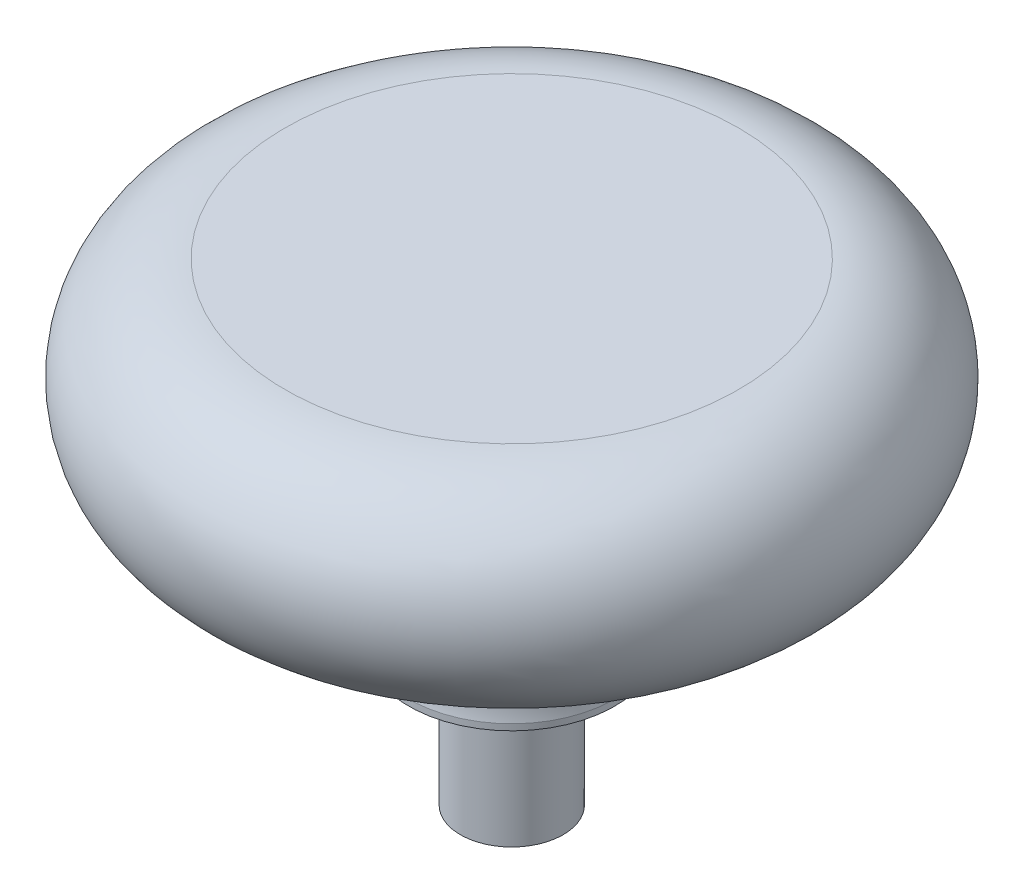
ISO-10303-21;
HEADER;
FILE_DESCRIPTION(('STEP AP214'),'2;1');
FILE_NAME('part.step','',(''),(''),'','','');
FILE_SCHEMA(('AUTOMOTIVE_DESIGN { 1 0 10303 214 1 1 1 1 }'));
ENDSEC;
DATA;
#1=APPLICATION_CONTEXT('core data for automotive mechanical design processes');
#2=APPLICATION_PROTOCOL_DEFINITION('international standard','automotive_design',2000,#1);
#3=PRODUCT_CONTEXT('',#1,'mechanical');
#4=PRODUCT('Part','Part','',(#3));
#5=PRODUCT_RELATED_PRODUCT_CATEGORY('part','',(#4));
#6=PRODUCT_DEFINITION_FORMATION('','',#4);
#7=PRODUCT_DEFINITION_CONTEXT('part definition',#1,'design');
#8=PRODUCT_DEFINITION('design','',#6,#7);
#9=PRODUCT_DEFINITION_SHAPE('','',#8);
#10=(LENGTH_UNIT() NAMED_UNIT(*) SI_UNIT(.MILLI.,.METRE.));
#11=(NAMED_UNIT(*) PLANE_ANGLE_UNIT() SI_UNIT($,.RADIAN.));
#12=(NAMED_UNIT(*) SI_UNIT($,.STERADIAN.) SOLID_ANGLE_UNIT());
#13=UNCERTAINTY_MEASURE_WITH_UNIT(LENGTH_MEASURE(1.E-05),#10,'distance_accuracy_value','');
#14=(GEOMETRIC_REPRESENTATION_CONTEXT(3) GLOBAL_UNCERTAINTY_ASSIGNED_CONTEXT((#13)) GLOBAL_UNIT_ASSIGNED_CONTEXT((#10,
#11,#12)) REPRESENTATION_CONTEXT('',''));
#15=CARTESIAN_POINT('',(0.,0.,0.));
#16=DIRECTION('',(0.,0.,1.));
#17=DIRECTION('',(1.,0.,0.));
#18=AXIS2_PLACEMENT_3D('',#15,#16,#17);
#19=CARTESIAN_POINT('',(0.,0.,0.));
#20=DIRECTION('',(0.,-1.,0.));
#21=DIRECTION('',(0.,0.,-1.));
#22=AXIS2_PLACEMENT_3D('',#19,#20,#21);
#23=PLANE('',#22);
#24=CARTESIAN_POINT('',(0.,0.,0.));
#25=DIRECTION('',(0.,-1.,0.));
#26=DIRECTION('',(0.,0.,-1.));
#27=AXIS2_PLACEMENT_3D('',#24,#25,#26);
#28=CIRCLE('',#27,2.38);
#29=CARTESIAN_POINT('',(0.,0.,-2.38));
#30=VERTEX_POINT('',#29);
#31=EDGE_CURVE('E10',#30,#30,#28,.T.);
#32=ORIENTED_EDGE('',*,*,#31,.T.);
#33=EDGE_LOOP('',(#32));
#34=FACE_BOUND('',#33,.T.);
#35=ADVANCED_FACE('F31',(#34),#23,.T.);
#36=CARTESIAN_POINT('',(0.,0.,0.));
#37=DIRECTION('',(0.,-1.,0.));
#38=DIRECTION('',(0.,0.,-1.));
#39=AXIS2_PLACEMENT_3D('',#36,#37,#38);
#40=CYLINDRICAL_SURFACE('',#39,2.38);
#41=CARTESIAN_POINT('',(0.,6.35,0.));
#42=DIRECTION('',(0.,-1.,0.));
#43=DIRECTION('',(0.,0.,-1.));
#44=AXIS2_PLACEMENT_3D('',#41,#42,#43);
#45=CIRCLE('',#44,2.38);
#46=CARTESIAN_POINT('',(0.,6.35,-2.38));
#47=VERTEX_POINT('',#46);
#48=EDGE_CURVE('E37',#47,#47,#45,.T.);
#49=ORIENTED_EDGE('',*,*,#48,.T.);
#50=EDGE_LOOP('',(#49));
#51=FACE_BOUND('',#50,.T.);
#52=ORIENTED_EDGE('',*,*,#31,.F.);
#53=EDGE_LOOP('',(#52));
#54=FACE_BOUND('',#53,.T.);
#55=ADVANCED_FACE('F69',(#51,#54),#40,.T.);
#56=CARTESIAN_POINT('',(2.38,6.35,0.));
#57=DIRECTION('',(0.,-1.,0.));
#58=DIRECTION('',(0.,0.,-1.));
#59=AXIS2_PLACEMENT_3D('',#56,#57,#58);
#60=PLANE('',#59);
#61=CARTESIAN_POINT('',(0.,6.35,0.));
#62=DIRECTION('',(0.,-1.,0.));
#63=DIRECTION('',(0.,0.,-1.));
#64=AXIS2_PLACEMENT_3D('',#61,#62,#63);
#65=CIRCLE('',#64,4.77);
#66=CARTESIAN_POINT('',(0.,6.35,-4.77));
#67=VERTEX_POINT('',#66);
#68=EDGE_CURVE('E41',#67,#67,#65,.T.);
#69=ORIENTED_EDGE('',*,*,#68,.T.);
#70=EDGE_LOOP('',(#69));
#71=FACE_BOUND('',#70,.T.);
#72=ORIENTED_EDGE('',*,*,#48,.F.);
#73=EDGE_LOOP('',(#72));
#74=FACE_BOUND('',#73,.T.);
#75=ADVANCED_FACE('F73',(#71,#74),#60,.T.);
#76=CARTESIAN_POINT('',(0.,0.,0.));
#77=DIRECTION('',(0.,-1.,0.));
#78=DIRECTION('',(0.,0.,-1.));
#79=AXIS2_PLACEMENT_3D('',#76,#77,#78);
#80=CYLINDRICAL_SURFACE('',#79,4.77);
#81=CARTESIAN_POINT('',(0.,6.63522611155576,0.));
#82=DIRECTION('',(0.,-1.,0.));
#83=DIRECTION('',(0.,0.,-1.));
#84=AXIS2_PLACEMENT_3D('',#81,#82,#83);
#85=CIRCLE('',#84,4.77);
#86=CARTESIAN_POINT('',(0.,6.63522611155576,-4.77));
#87=VERTEX_POINT('',#86);
#88=EDGE_CURVE('E45',#87,#87,#85,.T.);
#89=ORIENTED_EDGE('',*,*,#88,.T.);
#90=EDGE_LOOP('',(#89));
#91=FACE_BOUND('',#90,.T.);
#92=ORIENTED_EDGE('',*,*,#68,.F.);
#93=EDGE_LOOP('',(#92));
#94=FACE_BOUND('',#93,.T.);
#95=ADVANCED_FACE('F77',(#91,#94),#80,.T.);
#96=CARTESIAN_POINT('',(0.,7.73001681225589,0.));
#97=DIRECTION('',(0.,-1.,0.));
#98=DIRECTION('',(0.,0.,-1.));
#99=AXIS2_PLACEMENT_3D('',#96,#97,#98);
#100=TOROIDAL_SURFACE('',#99,9.41266446360929,4.77);
#101=CARTESIAN_POINT('',(0.,12.5,0.));
#102=DIRECTION('',(0.,-1.,0.));
#103=DIRECTION('',(0.,0.,-1.));
#104=AXIS2_PLACEMENT_3D('',#101,#102,#103);
#105=CIRCLE('',#104,9.4);
#106=CARTESIAN_POINT('',(0.,12.5,-9.4));
#107=VERTEX_POINT('',#106);
#108=EDGE_CURVE('E50',#107,#107,#105,.T.);
#109=ORIENTED_EDGE('',*,*,#108,.T.);
#110=EDGE_LOOP('',(#109));
#111=FACE_BOUND('',#110,.T.);
#112=ORIENTED_EDGE('',*,*,#88,.F.);
#113=EDGE_LOOP('',(#112));
#114=FACE_BOUND('',#113,.T.);
#115=ADVANCED_FACE('F66',(#111,#114),#100,.F.);
#116=CARTESIAN_POINT('',(0.,17.1414329683838,0.));
#117=DIRECTION('',(0.,-1.,0.));
#118=DIRECTION('',(0.,0.,-1.));
#119=AXIS2_PLACEMENT_3D('',#116,#117,#118);
#120=TOROIDAL_SURFACE('',#119,10.5,4.77);
#121=CARTESIAN_POINT('',(0.,21.9114329683838,0.));
#122=DIRECTION('',(0.,-1.,0.));
#123=DIRECTION('',(0.,0.,-1.));
#124=AXIS2_PLACEMENT_3D('',#121,#122,#123);
#125=CIRCLE('',#124,10.5);
#126=CARTESIAN_POINT('',(0.,21.9114329683838,-10.5));
#127=VERTEX_POINT('',#126);
#128=EDGE_CURVE('E53',#127,#127,#125,.T.);
#129=ORIENTED_EDGE('',*,*,#128,.T.);
#130=EDGE_LOOP('',(#129));
#131=FACE_BOUND('',#130,.T.);
#132=ORIENTED_EDGE('',*,*,#108,.F.);
#133=EDGE_LOOP('',(#132));
#134=FACE_BOUND('',#133,.T.);
#135=ADVANCED_FACE('F57',(#131,#134),#120,.T.);
#136=CARTESIAN_POINT('',(0.,21.9114329683838,0.));
#137=DIRECTION('',(0.,1.,0.));
#138=DIRECTION('',(0.,0.,1.));
#139=AXIS2_PLACEMENT_3D('',#136,#137,#138);
#140=PLANE('',#139);
#141=ORIENTED_EDGE('',*,*,#128,.F.);
#142=EDGE_LOOP('',(#141));
#143=FACE_BOUND('',#142,.T.);
#144=ADVANCED_FACE('F60',(#143),#140,.T.);
#145=CLOSED_SHELL('',(#35,#55,#75,#95,#115,#135,#144));
#146=MANIFOLD_SOLID_BREP('B2',#145);
#147=ADVANCED_BREP_SHAPE_REPRESENTATION('',(#18,#146),#14);
#148=SHAPE_DEFINITION_REPRESENTATION(#9,#147);
ENDSEC;
END-ISO-10303-21;
